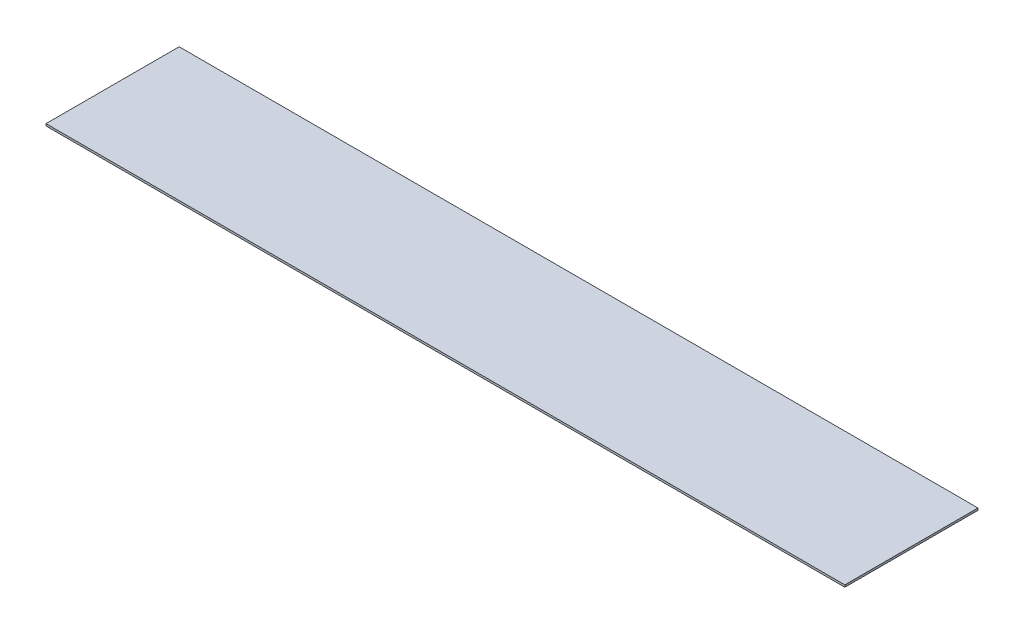
ISO-10303-21;
HEADER;
FILE_DESCRIPTION(('STEP AP214'),'2;1');
FILE_NAME('part.step','',(''),(''),'','','');
FILE_SCHEMA(('AUTOMOTIVE_DESIGN { 1 0 10303 214 1 1 1 1 }'));
ENDSEC;
DATA;
#1=APPLICATION_CONTEXT('core data for automotive mechanical design processes');
#2=APPLICATION_PROTOCOL_DEFINITION('international standard','automotive_design',2000,#1);
#3=PRODUCT_CONTEXT('',#1,'mechanical');
#4=PRODUCT('Part','Part','',(#3));
#5=PRODUCT_RELATED_PRODUCT_CATEGORY('part','',(#4));
#6=PRODUCT_DEFINITION_FORMATION('','',#4);
#7=PRODUCT_DEFINITION_CONTEXT('part definition',#1,'design');
#8=PRODUCT_DEFINITION('design','',#6,#7);
#9=PRODUCT_DEFINITION_SHAPE('','',#8);
#10=(LENGTH_UNIT() NAMED_UNIT(*) SI_UNIT(.MILLI.,.METRE.));
#11=(NAMED_UNIT(*) PLANE_ANGLE_UNIT() SI_UNIT($,.RADIAN.));
#12=(NAMED_UNIT(*) SI_UNIT($,.STERADIAN.) SOLID_ANGLE_UNIT());
#13=UNCERTAINTY_MEASURE_WITH_UNIT(LENGTH_MEASURE(1.E-05),#10,'distance_accuracy_value','');
#14=(GEOMETRIC_REPRESENTATION_CONTEXT(3) GLOBAL_UNCERTAINTY_ASSIGNED_CONTEXT((#13)) GLOBAL_UNIT_ASSIGNED_CONTEXT((#10,
#11,#12)) REPRESENTATION_CONTEXT('',''));
#15=CARTESIAN_POINT('',(0.,0.,0.));
#16=DIRECTION('',(0.,0.,1.));
#17=DIRECTION('',(1.,0.,0.));
#18=AXIS2_PLACEMENT_3D('',#15,#16,#17);
#19=CARTESIAN_POINT('',(-152.4,-0.79375,25.4));
#20=DIRECTION('',(0.,-1.,0.));
#21=DIRECTION('',(0.,0.,-1.));
#22=AXIS2_PLACEMENT_3D('',#19,#20,#21);
#23=PLANE('',#22);
#24=DIRECTION('',(1.,0.,0.));
#25=VECTOR('',#24,1.);
#26=CARTESIAN_POINT('',(-152.4,-0.79375,25.4));
#27=LINE('',#26,#25);
#28=CARTESIAN_POINT('',(-152.4,-0.79375,25.4));
#29=VERTEX_POINT('',#28);
#30=CARTESIAN_POINT('',(152.4,-0.79375,25.4));
#31=VERTEX_POINT('',#30);
#32=EDGE_CURVE('E20',#29,#31,#27,.T.);
#33=ORIENTED_EDGE('',*,*,#32,.F.);
#34=DIRECTION('',(0.,0.,-1.));
#35=VECTOR('',#34,1.);
#36=CARTESIAN_POINT('',(-152.4,-0.79375,0.));
#37=LINE('',#36,#35);
#38=CARTESIAN_POINT('',(-152.4,-0.79375,-25.4));
#39=VERTEX_POINT('',#38);
#40=EDGE_CURVE('E80',#29,#39,#37,.T.);
#41=ORIENTED_EDGE('',*,*,#40,.T.);
#42=DIRECTION('',(-1.,0.,0.));
#43=VECTOR('',#42,1.);
#44=CARTESIAN_POINT('',(-152.4,-0.79375,-25.4));
#45=LINE('',#44,#43);
#46=CARTESIAN_POINT('',(152.4,-0.79375,-25.4));
#47=VERTEX_POINT('',#46);
#48=EDGE_CURVE('E68',#47,#39,#45,.T.);
#49=ORIENTED_EDGE('',*,*,#48,.F.);
#50=DIRECTION('',(0.,0.,-1.));
#51=VECTOR('',#50,1.);
#52=CARTESIAN_POINT('',(152.4,-0.79375,0.));
#53=LINE('',#52,#51);
#54=EDGE_CURVE('E56',#31,#47,#53,.T.);
#55=ORIENTED_EDGE('',*,*,#54,.F.);
#56=EDGE_LOOP('',(#33,#41,#49,#55));
#57=FACE_BOUND('',#56,.T.);
#58=ADVANCED_FACE('F17',(#57),#23,.T.);
#59=CARTESIAN_POINT('',(-152.4,0.,25.4));
#60=DIRECTION('',(0.,0.,1.));
#61=DIRECTION('',(1.,0.,0.));
#62=AXIS2_PLACEMENT_3D('',#59,#60,#61);
#63=PLANE('',#62);
#64=DIRECTION('',(1.,0.,0.));
#65=VECTOR('',#64,1.);
#66=CARTESIAN_POINT('',(-152.4,0.,25.4));
#67=LINE('',#66,#65);
#68=CARTESIAN_POINT('',(-152.4,0.,25.4));
#69=VERTEX_POINT('',#68);
#70=CARTESIAN_POINT('',(152.4,0.,25.4));
#71=VERTEX_POINT('',#70);
#72=EDGE_CURVE('E83',#69,#71,#67,.T.);
#73=ORIENTED_EDGE('',*,*,#72,.F.);
#74=DIRECTION('',(0.,1.,0.));
#75=VECTOR('',#74,1.);
#76=CARTESIAN_POINT('',(-152.4,0.,25.4));
#77=LINE('',#76,#75);
#78=EDGE_CURVE('E65',#69,#29,#77,.F.);
#79=ORIENTED_EDGE('',*,*,#78,.T.);
#80=ORIENTED_EDGE('',*,*,#32,.T.);
#81=DIRECTION('',(0.,1.,0.));
#82=VECTOR('',#81,1.);
#83=CARTESIAN_POINT('',(152.4,0.,25.4));
#84=LINE('',#83,#82);
#85=EDGE_CURVE('E62',#71,#31,#84,.F.);
#86=ORIENTED_EDGE('',*,*,#85,.F.);
#87=EDGE_LOOP('',(#73,#79,#80,#86));
#88=FACE_BOUND('',#87,.T.);
#89=ADVANCED_FACE('F61',(#88),#63,.T.);
#90=CARTESIAN_POINT('',(152.4,0.,0.));
#91=DIRECTION('',(1.,0.,0.));
#92=DIRECTION('',(0.,0.,-1.));
#93=AXIS2_PLACEMENT_3D('',#90,#91,#92);
#94=PLANE('',#93);
#95=DIRECTION('',(0.,1.,0.));
#96=VECTOR('',#95,1.);
#97=CARTESIAN_POINT('',(152.4,-0.79375,-25.4));
#98=LINE('',#97,#96);
#99=CARTESIAN_POINT('',(152.4,0.,-25.4));
#100=VERTEX_POINT('',#99);
#101=EDGE_CURVE('E70',#100,#47,#98,.F.);
#102=ORIENTED_EDGE('',*,*,#101,.F.);
#103=DIRECTION('',(0.,0.,1.));
#104=VECTOR('',#103,1.);
#105=CARTESIAN_POINT('',(152.4,0.,-25.4));
#106=LINE('',#105,#104);
#107=EDGE_CURVE('E74',#71,#100,#106,.F.);
#108=ORIENTED_EDGE('',*,*,#107,.F.);
#109=ORIENTED_EDGE('',*,*,#85,.T.);
#110=ORIENTED_EDGE('',*,*,#54,.T.);
#111=EDGE_LOOP('',(#102,#108,#109,#110));
#112=FACE_BOUND('',#111,.T.);
#113=ADVANCED_FACE('F72',(#112),#94,.T.);
#114=CARTESIAN_POINT('',(-152.4,-0.79375,-25.4));
#115=DIRECTION('',(0.,0.,-1.));
#116=DIRECTION('',(-1.,0.,0.));
#117=AXIS2_PLACEMENT_3D('',#114,#115,#116);
#118=PLANE('',#117);
#119=ORIENTED_EDGE('',*,*,#48,.T.);
#120=DIRECTION('',(0.,1.,0.));
#121=VECTOR('',#120,1.);
#122=CARTESIAN_POINT('',(-152.4,0.,-25.4));
#123=LINE('',#122,#121);
#124=CARTESIAN_POINT('',(-152.4,0.,-25.4));
#125=VERTEX_POINT('',#124);
#126=EDGE_CURVE('E35',#39,#125,#123,.T.);
#127=ORIENTED_EDGE('',*,*,#126,.T.);
#128=DIRECTION('',(1.,0.,0.));
#129=VECTOR('',#128,1.);
#130=CARTESIAN_POINT('',(-152.4,0.,-25.4));
#131=LINE('',#130,#129);
#132=EDGE_CURVE('E26',#100,#125,#131,.F.);
#133=ORIENTED_EDGE('',*,*,#132,.F.);
#134=ORIENTED_EDGE('',*,*,#101,.T.);
#135=EDGE_LOOP('',(#119,#127,#133,#134));
#136=FACE_BOUND('',#135,.T.);
#137=ADVANCED_FACE('F89',(#136),#118,.T.);
#138=CARTESIAN_POINT('',(-152.4,0.,0.));
#139=DIRECTION('',(1.,0.,0.));
#140=DIRECTION('',(0.,0.,-1.));
#141=AXIS2_PLACEMENT_3D('',#138,#139,#140);
#142=PLANE('',#141);
#143=ORIENTED_EDGE('',*,*,#40,.F.);
#144=ORIENTED_EDGE('',*,*,#78,.F.);
#145=DIRECTION('',(0.,0.,1.));
#146=VECTOR('',#145,1.);
#147=CARTESIAN_POINT('',(-152.4,0.,-25.4));
#148=LINE('',#147,#146);
#149=EDGE_CURVE('E11',#125,#69,#148,.T.);
#150=ORIENTED_EDGE('',*,*,#149,.F.);
#151=ORIENTED_EDGE('',*,*,#126,.F.);
#152=EDGE_LOOP('',(#143,#144,#150,#151));
#153=FACE_BOUND('',#152,.T.);
#154=ADVANCED_FACE('F91',(#153),#142,.F.);
#155=CARTESIAN_POINT('',(-152.4,0.,-25.4));
#156=DIRECTION('',(0.,1.,0.));
#157=DIRECTION('',(0.,0.,1.));
#158=AXIS2_PLACEMENT_3D('',#155,#156,#157);
#159=PLANE('',#158);
#160=ORIENTED_EDGE('',*,*,#132,.T.);
#161=ORIENTED_EDGE('',*,*,#149,.T.);
#162=ORIENTED_EDGE('',*,*,#72,.T.);
#163=ORIENTED_EDGE('',*,*,#107,.T.);
#164=EDGE_LOOP('',(#160,#161,#162,#163));
#165=FACE_BOUND('',#164,.T.);
#166=ADVANCED_FACE('F88',(#165),#159,.T.);
#167=CLOSED_SHELL('',(#58,#89,#113,#137,#154,#166));
#168=MANIFOLD_SOLID_BREP('B1',#167);
#169=ADVANCED_BREP_SHAPE_REPRESENTATION('',(#18,#168),#14);
#170=SHAPE_DEFINITION_REPRESENTATION(#9,#169);
ENDSEC;
END-ISO-10303-21;
